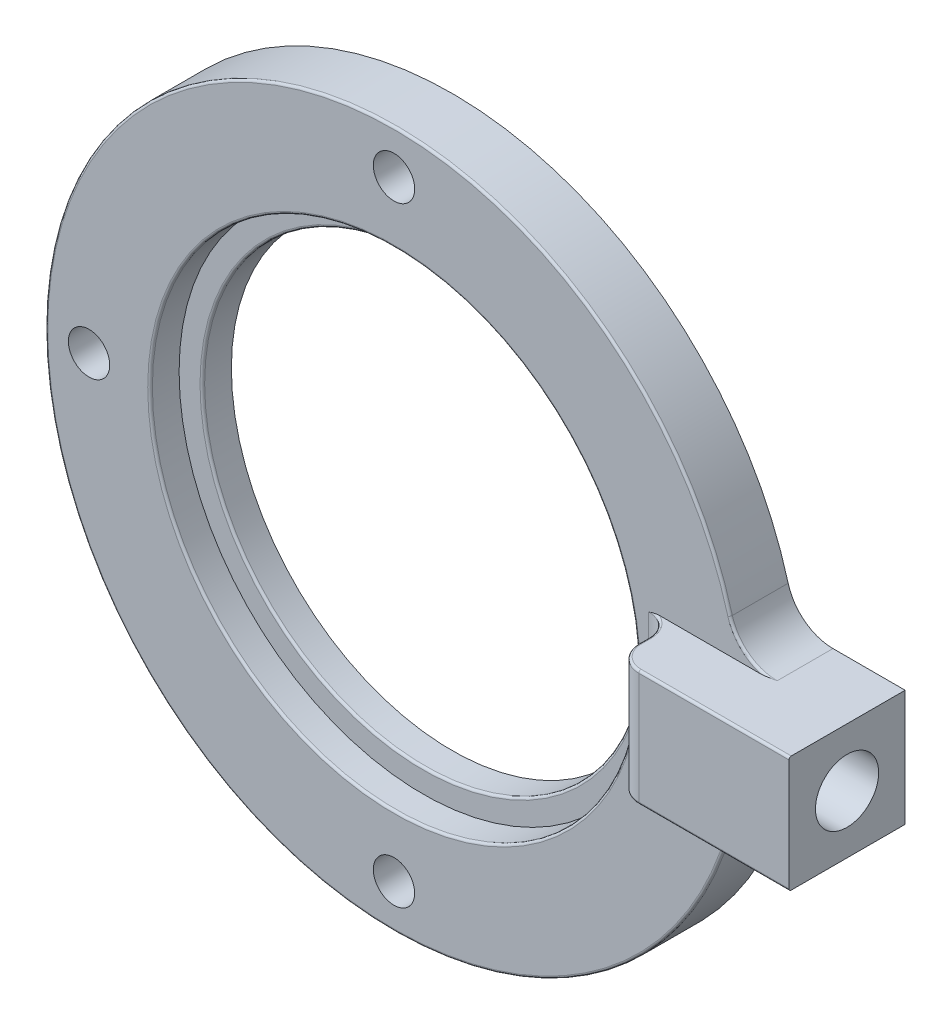
ISO-10303-21;
HEADER;
FILE_DESCRIPTION(('STEP AP214'),'2;1');
FILE_NAME('part.step','',(''),(''),'','','');
FILE_SCHEMA(('AUTOMOTIVE_DESIGN { 1 0 10303 214 1 1 1 1 }'));
ENDSEC;
DATA;
#1=APPLICATION_CONTEXT('core data for automotive mechanical design processes');
#2=APPLICATION_PROTOCOL_DEFINITION('international standard','automotive_design',2000,#1);
#3=PRODUCT_CONTEXT('',#1,'mechanical');
#4=PRODUCT('Part','Part','',(#3));
#5=PRODUCT_RELATED_PRODUCT_CATEGORY('part','',(#4));
#6=PRODUCT_DEFINITION_FORMATION('','',#4);
#7=PRODUCT_DEFINITION_CONTEXT('part definition',#1,'design');
#8=PRODUCT_DEFINITION('design','',#6,#7);
#9=PRODUCT_DEFINITION_SHAPE('','',#8);
#10=(LENGTH_UNIT() NAMED_UNIT(*) SI_UNIT(.MILLI.,.METRE.));
#11=(NAMED_UNIT(*) PLANE_ANGLE_UNIT() SI_UNIT($,.RADIAN.));
#12=(NAMED_UNIT(*) SI_UNIT($,.STERADIAN.) SOLID_ANGLE_UNIT());
#13=UNCERTAINTY_MEASURE_WITH_UNIT(LENGTH_MEASURE(1.E-05),#10,'distance_accuracy_value','');
#14=(GEOMETRIC_REPRESENTATION_CONTEXT(3) GLOBAL_UNCERTAINTY_ASSIGNED_CONTEXT((#13)) GLOBAL_UNIT_ASSIGNED_CONTEXT((#10,
#11,#12)) REPRESENTATION_CONTEXT('',''));
#15=CARTESIAN_POINT('',(0.,0.,0.));
#16=DIRECTION('',(0.,0.,1.));
#17=DIRECTION('',(1.,0.,0.));
#18=AXIS2_PLACEMENT_3D('',#15,#16,#17);
#19=CARTESIAN_POINT('',(0.,0.,3.175));
#20=DIRECTION('',(0.,0.,-1.));
#21=DIRECTION('',(-1.,0.,0.));
#22=AXIS2_PLACEMENT_3D('',#19,#20,#21);
#23=CYLINDRICAL_SURFACE('',#22,19.05);
#24=DIRECTION('',(0.,0.,-1.));
#25=VECTOR('',#24,1.);
#26=CARTESIAN_POINT('',(18.3704711599931,-5.04264705882353,3.175));
#27=LINE('',#26,#25);
#28=CARTESIAN_POINT('',(18.3704711599931,-5.04264705882353,0.));
#29=VERTEX_POINT('',#28);
#30=CARTESIAN_POINT('',(18.3704711599931,-5.04264705882353,3.048));
#31=VERTEX_POINT('',#30);
#32=EDGE_CURVE('E205',#29,#31,#27,.F.);
#33=ORIENTED_EDGE('',*,*,#32,.T.);
#34=CARTESIAN_POINT('',(0.,0.,3.048));
#35=DIRECTION('',(0.,0.,1.));
#36=DIRECTION('',(1.,0.,0.));
#37=AXIS2_PLACEMENT_3D('',#34,#35,#36);
#38=CIRCLE('',#37,19.05);
#39=CARTESIAN_POINT('',(18.3704711599931,5.04264705882353,3.048));
#40=VERTEX_POINT('',#39);
#41=EDGE_CURVE('E279',#31,#40,#38,.F.);
#42=ORIENTED_EDGE('',*,*,#41,.T.);
#43=DIRECTION('',(0.,0.,-1.));
#44=VECTOR('',#43,1.);
#45=CARTESIAN_POINT('',(18.3704711599931,5.04264705882353,3.175));
#46=LINE('',#45,#44);
#47=CARTESIAN_POINT('',(18.3704711599931,5.04264705882353,0.));
#48=VERTEX_POINT('',#47);
#49=EDGE_CURVE('E208',#40,#48,#46,.T.);
#50=ORIENTED_EDGE('',*,*,#49,.T.);
#51=CARTESIAN_POINT('',(0.,0.,0.));
#52=DIRECTION('',(0.,0.,1.));
#53=DIRECTION('',(1.,0.,0.));
#54=AXIS2_PLACEMENT_3D('',#51,#52,#53);
#55=CIRCLE('',#54,19.05);
#56=EDGE_CURVE('E199',#48,#29,#55,.T.);
#57=ORIENTED_EDGE('',*,*,#56,.T.);
#58=EDGE_LOOP('',(#33,#42,#50,#57));
#59=FACE_BOUND('',#58,.T.);
#60=ADVANCED_FACE('F35',(#59),#23,.T.);
#61=CARTESIAN_POINT('',(0.,0.,3.175));
#62=DIRECTION('',(0.,0.,1.));
#63=DIRECTION('',(1.,0.,0.));
#64=AXIS2_PLACEMENT_3D('',#61,#62,#63);
#65=PLANE('',#64);
#66=CARTESIAN_POINT('',(0.,16.66875,3.175));
#67=DIRECTION('',(0.,0.,1.));
#68=DIRECTION('',(1.,0.,0.));
#69=AXIS2_PLACEMENT_3D('',#66,#67,#68);
#70=CIRCLE('',#69,1.1303);
#71=CARTESIAN_POINT('',(1.1303,16.66875,3.175));
#72=VERTEX_POINT('',#71);
#73=EDGE_CURVE('E497',#72,#72,#70,.T.);
#74=ORIENTED_EDGE('',*,*,#73,.F.);
#75=EDGE_LOOP('',(#74));
#76=FACE_BOUND('',#75,.T.);
#77=CARTESIAN_POINT('',(0.,-16.66875,3.175));
#78=DIRECTION('',(0.,0.,1.));
#79=DIRECTION('',(1.,0.,0.));
#80=AXIS2_PLACEMENT_3D('',#77,#78,#79);
#81=CIRCLE('',#80,1.1303);
#82=CARTESIAN_POINT('',(1.1303,-16.66875,3.175));
#83=VERTEX_POINT('',#82);
#84=EDGE_CURVE('E491',#83,#83,#81,.T.);
#85=ORIENTED_EDGE('',*,*,#84,.F.);
#86=EDGE_LOOP('',(#85));
#87=FACE_BOUND('',#86,.T.);
#88=CARTESIAN_POINT('',(-16.66875,0.,3.175));
#89=DIRECTION('',(0.,0.,1.));
#90=DIRECTION('',(1.,0.,0.));
#91=AXIS2_PLACEMENT_3D('',#88,#89,#90);
#92=CIRCLE('',#91,1.1303);
#93=CARTESIAN_POINT('',(-15.53845,0.,3.175));
#94=VERTEX_POINT('',#93);
#95=EDGE_CURVE('E485',#94,#94,#92,.T.);
#96=ORIENTED_EDGE('',*,*,#95,.F.);
#97=EDGE_LOOP('',(#96));
#98=FACE_BOUND('',#97,.T.);
#99=CARTESIAN_POINT('',(0.,0.,3.175));
#100=DIRECTION('',(0.,0.,1.));
#101=DIRECTION('',(1.,0.,0.));
#102=AXIS2_PLACEMENT_3D('',#99,#100,#101);
#103=CIRCLE('',#102,13.462);
#104=CARTESIAN_POINT('',(13.462,0.,3.175));
#105=VERTEX_POINT('',#104);
#106=EDGE_CURVE('E233',#105,#105,#103,.F.);
#107=ORIENTED_EDGE('',*,*,#106,.T.);
#108=EDGE_LOOP('',(#107));
#109=FACE_BOUND('',#108,.T.);
#110=DIRECTION('',(1.,0.,0.));
#111=VECTOR('',#110,1.);
#112=CARTESIAN_POINT('',(0.,3.175,3.175));
#113=LINE('',#112,#111);
#114=CARTESIAN_POINT('',(14.5121689705204,3.175,3.175));
#115=VERTEX_POINT('',#114);
#116=CARTESIAN_POINT('',(20.0066705365049,3.175,3.175));
#117=VERTEX_POINT('',#116);
#118=EDGE_CURVE('E174',#115,#117,#113,.T.);
#119=ORIENTED_EDGE('',*,*,#118,.T.);
#120=CARTESIAN_POINT('',(20.8198673146589,5.715,3.175));
#121=DIRECTION('',(0.,0.,1.));
#122=DIRECTION('',(1.,0.,0.));
#123=AXIS2_PLACEMENT_3D('',#120,#121,#122);
#124=CIRCLE('',#123,2.667);
#125=CARTESIAN_POINT('',(18.2480013522598,5.0090294117647,3.175));
#126=VERTEX_POINT('',#125);
#127=EDGE_CURVE('E230',#117,#126,#124,.F.);
#128=ORIENTED_EDGE('',*,*,#127,.T.);
#129=CARTESIAN_POINT('',(0.,0.,3.175));
#130=DIRECTION('',(0.,0.,1.));
#131=DIRECTION('',(1.,0.,0.));
#132=AXIS2_PLACEMENT_3D('',#129,#130,#131);
#133=CIRCLE('',#132,18.923);
#134=CARTESIAN_POINT('',(18.2480013522598,-5.0090294117647,3.175));
#135=VERTEX_POINT('',#134);
#136=EDGE_CURVE('E226',#126,#135,#133,.T.);
#137=ORIENTED_EDGE('',*,*,#136,.T.);
#138=CARTESIAN_POINT('',(20.8198673146589,-5.715,3.175));
#139=DIRECTION('',(0.,0.,1.));
#140=DIRECTION('',(1.,0.,0.));
#141=AXIS2_PLACEMENT_3D('',#138,#139,#140);
#142=CIRCLE('',#141,2.667);
#143=CARTESIAN_POINT('',(20.0066705365049,-3.175,3.175));
#144=VERTEX_POINT('',#143);
#145=EDGE_CURVE('E228',#135,#144,#142,.F.);
#146=ORIENTED_EDGE('',*,*,#145,.T.);
#147=DIRECTION('',(-1.,0.,0.));
#148=VECTOR('',#147,1.);
#149=CARTESIAN_POINT('',(0.,-3.175,3.175));
#150=LINE('',#149,#148);
#151=CARTESIAN_POINT('',(14.5121689705204,-3.175,3.175));
#152=VERTEX_POINT('',#151);
#153=EDGE_CURVE('E190',#144,#152,#150,.T.);
#154=ORIENTED_EDGE('',*,*,#153,.T.);
#155=CARTESIAN_POINT('',(14.5121689705204,-3.175,3.175));
#156=CARTESIAN_POINT('',(14.490697195344,-3.17497975884267,3.175));
#157=CARTESIAN_POINT('',(14.4692504761618,-3.17408902116841,3.175));
#158=CARTESIAN_POINT('',(14.426494060143,-3.17089117084889,3.175));
#159=CARTESIAN_POINT('',(14.4051841984233,-3.16858633814492,3.175));
#160=CARTESIAN_POINT('',(14.3628370270473,-3.16289862854949,3.175));
#161=CARTESIAN_POINT('',(14.3417988608336,-3.15952181473834,3.175));
#162=CARTESIAN_POINT('',(14.2998716225293,-3.15190166302931,3.175));
#163=CARTESIAN_POINT('',(14.2789826245387,-3.14765792178961,3.175));
#164=CARTESIAN_POINT('',(14.2020779938584,-3.13073562530817,3.175));
#165=CARTESIAN_POINT('',(14.1465342068225,-3.11595191436639,3.175));
#166=CARTESIAN_POINT('',(14.0360369041027,-3.08417963785667,3.175));
#167=CARTESIAN_POINT('',(13.9810844759537,-3.06718757981551,3.175));
#168=CARTESIAN_POINT('',(13.9238283053032,-3.04943517549649,3.175));
#169=CARTESIAN_POINT('',(13.9215141557331,-3.04871758649849,3.175));
#170=CARTESIAN_POINT('',(13.9192,-3.048,3.175));
#171=B_SPLINE_CURVE_WITH_KNOTS('',3,(#155,#156,#157,#158,#159,#160,#161,#162,#163,#164,#165,
#166,#167,#168,#169,#170),.UNSPECIFIED.,.F.,.F.,(4,2,2,2,2,2,2,4),(0.,0.0643629121915494,
0.128622323958822,0.192524575435322,0.256456625706736,0.428747907985684,0.601315060117932,
0.608583622856021),.UNSPECIFIED.);
#172=CARTESIAN_POINT('',(13.9192,-3.048,3.175));
#173=VERTEX_POINT('',#172);
#174=EDGE_CURVE('E44',#152,#173,#171,.T.);
#175=ORIENTED_EDGE('',*,*,#174,.T.);
#176=DIRECTION('',(0.,1.,0.));
#177=VECTOR('',#176,1.);
#178=CARTESIAN_POINT('',(13.9192,0.,3.175));
#179=LINE('',#178,#177);
#180=CARTESIAN_POINT('',(13.9192,3.048,3.175));
#181=VERTEX_POINT('',#180);
#182=EDGE_CURVE('E223',#173,#181,#179,.T.);
#183=ORIENTED_EDGE('',*,*,#182,.T.);
#184=CARTESIAN_POINT('',(14.5121689705204,3.175,3.175));
#185=CARTESIAN_POINT('',(14.490697195344,3.17497975884267,3.175));
#186=CARTESIAN_POINT('',(14.4692504761618,3.17408902116842,3.175));
#187=CARTESIAN_POINT('',(14.426494060143,3.17089117084889,3.175));
#188=CARTESIAN_POINT('',(14.4051841984233,3.16858633814492,3.175));
#189=CARTESIAN_POINT('',(14.3628370270473,3.16289862854949,3.175));
#190=CARTESIAN_POINT('',(14.3417988608336,3.15952181473834,3.175));
#191=CARTESIAN_POINT('',(14.2998716225293,3.15190166302931,3.175));
#192=CARTESIAN_POINT('',(14.2789826245387,3.14765792178962,3.175));
#193=CARTESIAN_POINT('',(14.2020779938584,3.13073562530817,3.175));
#194=CARTESIAN_POINT('',(14.1465342068225,3.11595191436639,3.175));
#195=CARTESIAN_POINT('',(14.0360369041027,3.08417963785667,3.175));
#196=CARTESIAN_POINT('',(13.9810844759537,3.0671875798155,3.175));
#197=CARTESIAN_POINT('',(13.9238283053032,3.04943517549649,3.175));
#198=CARTESIAN_POINT('',(13.9215141557331,3.04871758649849,3.175));
#199=CARTESIAN_POINT('',(13.9192,3.048,3.175));
#200=B_SPLINE_CURVE_WITH_KNOTS('',3,(#184,#185,#186,#187,#188,#189,#190,#191,#192,#193,#194,
#195,#196,#197,#198,#199),.UNSPECIFIED.,.F.,.F.,(4,2,2,2,2,2,2,4),(0.,0.0643629121915512,
0.128622323958824,0.192524575435323,0.256456625706736,0.42874790798568,0.60131506011793,
0.608583622856021),.UNSPECIFIED.);
#201=EDGE_CURVE('E12',#181,#115,#200,.F.);
#202=ORIENTED_EDGE('',*,*,#201,.T.);
#203=EDGE_LOOP('',(#119,#128,#137,#146,#154,#175,#183,#202));
#204=FACE_BOUND('',#203,.T.);
#205=ADVANCED_FACE('F328',(#76,#87,#98,#109,#204),#65,.T.);
#206=CARTESIAN_POINT('',(0.,0.,0.));
#207=DIRECTION('',(0.,0.,1.));
#208=DIRECTION('',(1.,0.,0.));
#209=AXIS2_PLACEMENT_3D('',#206,#207,#208);
#210=CYLINDRICAL_SURFACE('',#209,12.065);
#211=CARTESIAN_POINT('',(0.,0.,1.4605));
#212=DIRECTION('',(0.,0.,1.));
#213=DIRECTION('',(1.,0.,0.));
#214=AXIS2_PLACEMENT_3D('',#211,#212,#213);
#215=CIRCLE('',#214,12.065);
#216=CARTESIAN_POINT('',(12.065,0.,1.4605));
#217=VERTEX_POINT('',#216);
#218=EDGE_CURVE('E273',#217,#217,#215,.T.);
#219=ORIENTED_EDGE('',*,*,#218,.T.);
#220=EDGE_LOOP('',(#219));
#221=FACE_BOUND('',#220,.T.);
#222=CARTESIAN_POINT('',(0.,0.,0.));
#223=DIRECTION('',(0.,0.,1.));
#224=DIRECTION('',(1.,0.,0.));
#225=AXIS2_PLACEMENT_3D('',#222,#223,#224);
#226=CIRCLE('',#225,12.065);
#227=CARTESIAN_POINT('',(12.065,0.,0.));
#228=VERTEX_POINT('',#227);
#229=EDGE_CURVE('E196',#228,#228,#226,.T.);
#230=ORIENTED_EDGE('',*,*,#229,.F.);
#231=EDGE_LOOP('',(#230));
#232=FACE_BOUND('',#231,.T.);
#233=ADVANCED_FACE('F325',(#221,#232),#210,.F.);
#234=CARTESIAN_POINT('',(0.,0.,0.));
#235=DIRECTION('',(0.,0.,1.));
#236=DIRECTION('',(1.,0.,0.));
#237=AXIS2_PLACEMENT_3D('',#234,#235,#236);
#238=PLANE('',#237);
#239=CARTESIAN_POINT('',(0.,16.66875,0.));
#240=DIRECTION('',(0.,0.,1.));
#241=DIRECTION('',(1.,0.,0.));
#242=AXIS2_PLACEMENT_3D('',#239,#240,#241);
#243=CIRCLE('',#242,1.1303);
#244=CARTESIAN_POINT('',(1.1303,16.66875,0.));
#245=VERTEX_POINT('',#244);
#246=EDGE_CURVE('E488',#245,#245,#243,.T.);
#247=ORIENTED_EDGE('',*,*,#246,.T.);
#248=EDGE_LOOP('',(#247));
#249=FACE_BOUND('',#248,.T.);
#250=CARTESIAN_POINT('',(0.,-16.66875,0.));
#251=DIRECTION('',(0.,0.,1.));
#252=DIRECTION('',(1.,0.,0.));
#253=AXIS2_PLACEMENT_3D('',#250,#251,#252);
#254=CIRCLE('',#253,1.1303);
#255=CARTESIAN_POINT('',(1.1303,-16.66875,0.));
#256=VERTEX_POINT('',#255);
#257=EDGE_CURVE('E494',#256,#256,#254,.T.);
#258=ORIENTED_EDGE('',*,*,#257,.T.);
#259=EDGE_LOOP('',(#258));
#260=FACE_BOUND('',#259,.T.);
#261=CARTESIAN_POINT('',(-16.66875,0.,0.));
#262=DIRECTION('',(0.,0.,1.));
#263=DIRECTION('',(1.,0.,0.));
#264=AXIS2_PLACEMENT_3D('',#261,#262,#263);
#265=CIRCLE('',#264,1.1303);
#266=CARTESIAN_POINT('',(-15.53845,0.,0.));
#267=VERTEX_POINT('',#266);
#268=EDGE_CURVE('E430',#267,#267,#265,.T.);
#269=ORIENTED_EDGE('',*,*,#268,.T.);
#270=EDGE_LOOP('',(#269));
#271=FACE_BOUND('',#270,.T.);
#272=ORIENTED_EDGE('',*,*,#56,.F.);
#273=CARTESIAN_POINT('',(20.8198673146589,5.715,0.));
#274=DIRECTION('',(0.,0.,1.));
#275=DIRECTION('',(1.,0.,0.));
#276=AXIS2_PLACEMENT_3D('',#273,#274,#275);
#277=CIRCLE('',#276,2.54);
#278=CARTESIAN_POINT('',(20.8198673146589,3.175,0.));
#279=VERTEX_POINT('',#278);
#280=EDGE_CURVE('E211',#48,#279,#277,.T.);
#281=ORIENTED_EDGE('',*,*,#280,.T.);
#282=DIRECTION('',(-1.,0.,0.));
#283=VECTOR('',#282,1.);
#284=CARTESIAN_POINT('',(24.765,3.175,0.));
#285=LINE('',#284,#283);
#286=CARTESIAN_POINT('',(24.765,3.175,0.));
#287=VERTEX_POINT('',#286);
#288=EDGE_CURVE('E175',#287,#279,#285,.T.);
#289=ORIENTED_EDGE('',*,*,#288,.F.);
#290=DIRECTION('',(0.,1.,0.));
#291=VECTOR('',#290,1.);
#292=CARTESIAN_POINT('',(24.765,-3.175,0.));
#293=LINE('',#292,#291);
#294=CARTESIAN_POINT('',(24.765,-3.175,0.));
#295=VERTEX_POINT('',#294);
#296=EDGE_CURVE('E159',#295,#287,#293,.T.);
#297=ORIENTED_EDGE('',*,*,#296,.F.);
#298=DIRECTION('',(-1.,0.,0.));
#299=VECTOR('',#298,1.);
#300=CARTESIAN_POINT('',(24.765,-3.175,0.));
#301=LINE('',#300,#299);
#302=CARTESIAN_POINT('',(20.8198673146589,-3.175,0.));
#303=VERTEX_POINT('',#302);
#304=EDGE_CURVE('E168',#295,#303,#301,.T.);
#305=ORIENTED_EDGE('',*,*,#304,.T.);
#306=CARTESIAN_POINT('',(20.8198673146589,-5.715,0.));
#307=DIRECTION('',(0.,0.,1.));
#308=DIRECTION('',(1.,0.,0.));
#309=AXIS2_PLACEMENT_3D('',#306,#307,#308);
#310=CIRCLE('',#309,2.54);
#311=EDGE_CURVE('E213',#303,#29,#310,.T.);
#312=ORIENTED_EDGE('',*,*,#311,.T.);
#313=EDGE_LOOP('',(#272,#281,#289,#297,#305,#312));
#314=FACE_BOUND('',#313,.T.);
#315=ORIENTED_EDGE('',*,*,#229,.T.);
#316=EDGE_LOOP('',(#315));
#317=FACE_BOUND('',#316,.T.);
#318=ADVANCED_FACE('F178',(#249,#260,#271,#314,#317),#238,.F.);
#319=CARTESIAN_POINT('',(0.,0.,1.5875));
#320=DIRECTION('',(0.,0.,1.));
#321=DIRECTION('',(1.,0.,0.));
#322=AXIS2_PLACEMENT_3D('',#319,#320,#321);
#323=PLANE('',#322);
#324=CARTESIAN_POINT('',(0.,0.,1.5875));
#325=DIRECTION('',(0.,0.,1.));
#326=DIRECTION('',(1.,0.,0.));
#327=AXIS2_PLACEMENT_3D('',#324,#325,#326);
#328=CIRCLE('',#327,12.192);
#329=CARTESIAN_POINT('',(12.192,0.,1.5875));
#330=VERTEX_POINT('',#329);
#331=EDGE_CURVE('E270',#330,#330,#328,.F.);
#332=ORIENTED_EDGE('',*,*,#331,.T.);
#333=EDGE_LOOP('',(#332));
#334=FACE_BOUND('',#333,.T.);
#335=CARTESIAN_POINT('',(0.,0.,1.5875));
#336=DIRECTION('',(0.,0.,1.));
#337=DIRECTION('',(1.,0.,0.));
#338=AXIS2_PLACEMENT_3D('',#335,#336,#337);
#339=CIRCLE('',#338,13.335);
#340=CARTESIAN_POINT('',(13.335,0.,1.5875));
#341=VERTEX_POINT('',#340);
#342=EDGE_CURVE('E193',#341,#341,#339,.F.);
#343=ORIENTED_EDGE('',*,*,#342,.F.);
#344=EDGE_LOOP('',(#343));
#345=FACE_BOUND('',#344,.T.);
#346=ADVANCED_FACE('F318',(#334,#345),#323,.T.);
#347=CARTESIAN_POINT('',(0.,0.,-37.7170757084904));
#348=DIRECTION('',(0.,0.,1.));
#349=DIRECTION('',(1.,0.,0.));
#350=AXIS2_PLACEMENT_3D('',#347,#348,#349);
#351=CYLINDRICAL_SURFACE('',#350,13.335);
#352=CARTESIAN_POINT('',(0.,0.,3.048));
#353=DIRECTION('',(0.,0.,1.));
#354=DIRECTION('',(1.,0.,0.));
#355=AXIS2_PLACEMENT_3D('',#352,#353,#354);
#356=CIRCLE('',#355,13.335);
#357=CARTESIAN_POINT('',(13.335,0.,3.048));
#358=VERTEX_POINT('',#357);
#359=EDGE_CURVE('E276',#358,#358,#356,.T.);
#360=ORIENTED_EDGE('',*,*,#359,.T.);
#361=EDGE_LOOP('',(#360));
#362=FACE_BOUND('',#361,.T.);
#363=ORIENTED_EDGE('',*,*,#342,.T.);
#364=EDGE_LOOP('',(#363));
#365=FACE_BOUND('',#364,.T.);
#366=ADVANCED_FACE('F315',(#362,#365),#351,.F.);
#367=CARTESIAN_POINT('',(24.765,-3.175,0.));
#368=DIRECTION('',(0.,1.,0.));
#369=DIRECTION('',(0.,0.,1.));
#370=AXIS2_PLACEMENT_3D('',#367,#368,#369);
#371=PLANE('',#370);
#372=DIRECTION('',(0.,0.,-1.));
#373=VECTOR('',#372,1.);
#374=CARTESIAN_POINT('',(15.367,-3.175,0.));
#375=LINE('',#374,#373);
#376=CARTESIAN_POINT('',(15.367,-3.175,5.0292));
#377=VERTEX_POINT('',#376);
#378=CARTESIAN_POINT('',(15.367,-3.175,4.4958));
#379=VERTEX_POINT('',#378);
#380=EDGE_CURVE('E244',#377,#379,#375,.T.);
#381=ORIENTED_EDGE('',*,*,#380,.T.);
#382=CARTESIAN_POINT('',(13.9192,-3.175,4.4958));
#383=DIRECTION('',(0.,1.,0.));
#384=DIRECTION('',(0.,0.,1.));
#385=AXIS2_PLACEMENT_3D('',#382,#383,#384);
#386=CIRCLE('',#385,1.4478);
#387=EDGE_CURVE('E246',#379,#152,#386,.T.);
#388=ORIENTED_EDGE('',*,*,#387,.T.);
#389=ORIENTED_EDGE('',*,*,#153,.F.);
#390=CARTESIAN_POINT('',(20.0066705365049,-3.175,3.175));
#391=CARTESIAN_POINT('',(20.027946612039,-3.175,3.17499285010355));
#392=CARTESIAN_POINT('',(20.0492154190392,-3.175,3.17450392293874));
#393=CARTESIAN_POINT('',(20.0917094310848,-3.175,3.17271146799838));
#394=CARTESIAN_POINT('',(20.1129346521213,-3.175,3.1714083300243));
#395=CARTESIAN_POINT('',(20.1764249941339,-3.175,3.16650826044101));
#396=CARTESIAN_POINT('',(20.2186122298688,-3.175,3.16191913043132));
#397=CARTESIAN_POINT('',(20.3068869422796,-3.175,3.15033108499017));
#398=CARTESIAN_POINT('',(20.3529476655832,-3.175,3.14313878143618));
#399=CARTESIAN_POINT('',(20.4448080654936,-3.175,3.1272265592785));
#400=CARTESIAN_POINT('',(20.4906076865312,-3.175,3.11850632716824));
#401=CARTESIAN_POINT('',(20.6278195206221,-3.175,3.090893931761));
#402=CARTESIAN_POINT('',(20.7189355808589,-3.17500000000001,3.07056732551881));
#403=CARTESIAN_POINT('',(20.8133094819826,-3.175,3.04946634758811));
#404=CARTESIAN_POINT('',(20.8165884032865,-3.175,3.04873315690517));
#405=CARTESIAN_POINT('',(20.8198673146589,-3.175,3.048));
#406=B_SPLINE_CURVE_WITH_KNOTS('',3,(#390,#391,#392,#393,#394,#395,#396,#397,#398,#399,#400,
#401,#402,#403,#404,#405),.UNSPECIFIED.,.F.,.F.,(4,2,2,2,2,2,2,4),(0.,0.063812167547438,
0.127593808556728,0.254835432874251,0.394656814457322,0.534506918826331,0.814538203590491,
0.824617886149236),.UNSPECIFIED.);
#407=CARTESIAN_POINT('',(20.8198673146589,-3.175,3.048));
#408=VERTEX_POINT('',#407);
#409=EDGE_CURVE('E293',#144,#408,#406,.T.);
#410=ORIENTED_EDGE('',*,*,#409,.T.);
#411=DIRECTION('',(0.,0.,1.));
#412=VECTOR('',#411,1.);
#413=CARTESIAN_POINT('',(20.8198673146589,-3.175,0.));
#414=LINE('',#413,#412);
#415=EDGE_CURVE('E171',#408,#303,#414,.F.);
#416=ORIENTED_EDGE('',*,*,#415,.T.);
#417=ORIENTED_EDGE('',*,*,#304,.F.);
#418=DIRECTION('',(0.,0.,-1.));
#419=VECTOR('',#418,1.);
#420=CARTESIAN_POINT('',(24.765,-3.175,0.));
#421=LINE('',#420,#419);
#422=CARTESIAN_POINT('',(24.765,-3.175,6.223));
#423=VERTEX_POINT('',#422);
#424=EDGE_CURVE('E155',#423,#295,#421,.T.);
#425=ORIENTED_EDGE('',*,*,#424,.F.);
#426=DIRECTION('',(-1.,0.,0.));
#427=VECTOR('',#426,1.);
#428=CARTESIAN_POINT('',(24.765,-3.175,6.223));
#429=LINE('',#428,#427);
#430=CARTESIAN_POINT('',(16.5608,-3.175,6.223));
#431=VERTEX_POINT('',#430);
#432=EDGE_CURVE('E240',#423,#431,#429,.T.);
#433=ORIENTED_EDGE('',*,*,#432,.T.);
#434=CARTESIAN_POINT('',(16.5608,-3.175,5.0292));
#435=DIRECTION('',(0.,1.,0.));
#436=DIRECTION('',(0.,0.,1.));
#437=AXIS2_PLACEMENT_3D('',#434,#435,#436);
#438=CIRCLE('',#437,1.1938);
#439=EDGE_CURVE('E242',#431,#377,#438,.F.);
#440=ORIENTED_EDGE('',*,*,#439,.T.);
#441=EDGE_LOOP('',(#381,#388,#389,#410,#416,#417,#425,#433,#440));
#442=FACE_BOUND('',#441,.T.);
#443=ADVANCED_FACE('F169',(#442),#371,.F.);
#444=CARTESIAN_POINT('',(24.765,3.175,0.));
#445=DIRECTION('',(0.,-1.,0.));
#446=DIRECTION('',(0.,0.,-1.));
#447=AXIS2_PLACEMENT_3D('',#444,#445,#446);
#448=PLANE('',#447);
#449=ORIENTED_EDGE('',*,*,#118,.F.);
#450=CARTESIAN_POINT('',(13.9192,3.175,4.4958));
#451=DIRECTION('',(0.,-1.,0.));
#452=DIRECTION('',(0.,0.,-1.));
#453=AXIS2_PLACEMENT_3D('',#450,#451,#452);
#454=CIRCLE('',#453,1.4478);
#455=CARTESIAN_POINT('',(15.367,3.175,4.4958));
#456=VERTEX_POINT('',#455);
#457=EDGE_CURVE('E267',#115,#456,#454,.T.);
#458=ORIENTED_EDGE('',*,*,#457,.T.);
#459=DIRECTION('',(0.,0.,1.));
#460=VECTOR('',#459,1.);
#461=CARTESIAN_POINT('',(15.367,3.175,0.));
#462=LINE('',#461,#460);
#463=CARTESIAN_POINT('',(15.367,3.175,5.0292));
#464=VERTEX_POINT('',#463);
#465=EDGE_CURVE('E265',#456,#464,#462,.T.);
#466=ORIENTED_EDGE('',*,*,#465,.T.);
#467=CARTESIAN_POINT('',(16.5608,3.175,5.0292));
#468=DIRECTION('',(0.,-1.,0.));
#469=DIRECTION('',(0.,0.,-1.));
#470=AXIS2_PLACEMENT_3D('',#467,#468,#469);
#471=CIRCLE('',#470,1.1938);
#472=CARTESIAN_POINT('',(16.5608,3.175,6.223));
#473=VERTEX_POINT('',#472);
#474=EDGE_CURVE('E263',#464,#473,#471,.F.);
#475=ORIENTED_EDGE('',*,*,#474,.T.);
#476=DIRECTION('',(-1.,0.,0.));
#477=VECTOR('',#476,1.);
#478=CARTESIAN_POINT('',(24.765,3.175,6.223));
#479=LINE('',#478,#477);
#480=CARTESIAN_POINT('',(24.765,3.175,6.223));
#481=VERTEX_POINT('',#480);
#482=EDGE_CURVE('E261',#473,#481,#479,.F.);
#483=ORIENTED_EDGE('',*,*,#482,.T.);
#484=DIRECTION('',(0.,0.,1.));
#485=VECTOR('',#484,1.);
#486=CARTESIAN_POINT('',(24.765,3.175,0.));
#487=LINE('',#486,#485);
#488=EDGE_CURVE('E182',#287,#481,#487,.T.);
#489=ORIENTED_EDGE('',*,*,#488,.F.);
#490=ORIENTED_EDGE('',*,*,#288,.T.);
#491=DIRECTION('',(0.,0.,1.));
#492=VECTOR('',#491,1.);
#493=CARTESIAN_POINT('',(20.8198673146589,3.175,3.175));
#494=LINE('',#493,#492);
#495=CARTESIAN_POINT('',(20.8198673146589,3.175,3.048));
#496=VERTEX_POINT('',#495);
#497=EDGE_CURVE('E202',#279,#496,#494,.T.);
#498=ORIENTED_EDGE('',*,*,#497,.T.);
#499=CARTESIAN_POINT('',(20.0066705365049,3.175,3.175));
#500=CARTESIAN_POINT('',(20.027946612039,3.175,3.17499285010355));
#501=CARTESIAN_POINT('',(20.0492154190392,3.175,3.17450392293874));
#502=CARTESIAN_POINT('',(20.0917094310848,3.175,3.17271146799838));
#503=CARTESIAN_POINT('',(20.1129346521213,3.175,3.1714083300243));
#504=CARTESIAN_POINT('',(20.1764249941339,3.175,3.16650826044101));
#505=CARTESIAN_POINT('',(20.2186122298688,3.175,3.16191913043132));
#506=CARTESIAN_POINT('',(20.3068869422796,3.175,3.15033108499018));
#507=CARTESIAN_POINT('',(20.3529476655832,3.175,3.14313878143619));
#508=CARTESIAN_POINT('',(20.4448080654936,3.175,3.12722655927849));
#509=CARTESIAN_POINT('',(20.4906076865312,3.175,3.1185063271682));
#510=CARTESIAN_POINT('',(20.6278195206221,3.175,3.09089393176108));
#511=CARTESIAN_POINT('',(20.718935580859,3.17500000000001,3.07056732551926));
#512=CARTESIAN_POINT('',(20.8133094819826,3.175,3.04946634758814));
#513=CARTESIAN_POINT('',(20.8165884032865,3.175,3.04873315690519));
#514=CARTESIAN_POINT('',(20.8198673146589,3.175,3.048));
#515=B_SPLINE_CURVE_WITH_KNOTS('',3,(#499,#500,#501,#502,#503,#504,#505,#506,#507,#508,#509,
#510,#511,#512,#513,#514),.UNSPECIFIED.,.F.,.F.,(4,2,2,2,2,2,2,4),(0.,0.0638121675474242,
0.127593808556703,0.254835432874251,0.394656814457315,0.534506918826331,0.814538203590481,
0.824617886149234),.UNSPECIFIED.);
#516=EDGE_CURVE('E286',#496,#117,#515,.F.);
#517=ORIENTED_EDGE('',*,*,#516,.T.);
#518=EDGE_LOOP('',(#449,#458,#466,#475,#483,#489,#490,#498,#517));
#519=FACE_BOUND('',#518,.T.);
#520=ADVANCED_FACE('F304',(#519),#448,.F.);
#521=CARTESIAN_POINT('',(24.765,-3.175,6.35));
#522=DIRECTION('',(0.,0.,-1.));
#523=DIRECTION('',(-1.,0.,0.));
#524=AXIS2_PLACEMENT_3D('',#521,#522,#523);
#525=PLANE('',#524);
#526=DIRECTION('',(0.,-1.,0.));
#527=VECTOR('',#526,1.);
#528=CARTESIAN_POINT('',(16.5608,-3.175,6.35));
#529=LINE('',#528,#527);
#530=CARTESIAN_POINT('',(16.5608,3.048,6.35));
#531=VERTEX_POINT('',#530);
#532=CARTESIAN_POINT('',(16.5608,-3.048,6.35));
#533=VERTEX_POINT('',#532);
#534=EDGE_CURVE('E215',#531,#533,#529,.T.);
#535=ORIENTED_EDGE('',*,*,#534,.T.);
#536=DIRECTION('',(-1.,0.,0.));
#537=VECTOR('',#536,1.);
#538=CARTESIAN_POINT('',(24.765,-3.048,6.35));
#539=LINE('',#538,#537);
#540=CARTESIAN_POINT('',(24.765,-3.048,6.35));
#541=VERTEX_POINT('',#540);
#542=EDGE_CURVE('E52',#533,#541,#539,.F.);
#543=ORIENTED_EDGE('',*,*,#542,.T.);
#544=DIRECTION('',(0.,-1.,0.));
#545=VECTOR('',#544,1.);
#546=CARTESIAN_POINT('',(24.765,-3.175,6.35));
#547=LINE('',#546,#545);
#548=CARTESIAN_POINT('',(24.765,3.048,6.35));
#549=VERTEX_POINT('',#548);
#550=EDGE_CURVE('E165',#549,#541,#547,.T.);
#551=ORIENTED_EDGE('',*,*,#550,.F.);
#552=DIRECTION('',(-1.,0.,0.));
#553=VECTOR('',#552,1.);
#554=CARTESIAN_POINT('',(24.765,3.048,6.35));
#555=LINE('',#554,#553);
#556=EDGE_CURVE('E281',#549,#531,#555,.T.);
#557=ORIENTED_EDGE('',*,*,#556,.T.);
#558=EDGE_LOOP('',(#535,#543,#551,#557));
#559=FACE_BOUND('',#558,.T.);
#560=ADVANCED_FACE('F308',(#559),#525,.F.);
#561=CARTESIAN_POINT('',(24.765,0.,0.));
#562=DIRECTION('',(1.,0.,0.));
#563=DIRECTION('',(0.,0.,-1.));
#564=AXIS2_PLACEMENT_3D('',#561,#562,#563);
#565=PLANE('',#564);
#566=CARTESIAN_POINT('',(24.765,0.,3.175));
#567=DIRECTION('',(1.,0.,0.));
#568=DIRECTION('',(0.,0.,-1.));
#569=AXIS2_PLACEMENT_3D('',#566,#567,#568);
#570=CIRCLE('',#569,1.7272);
#571=CARTESIAN_POINT('',(24.765,0.,1.4478));
#572=VERTEX_POINT('',#571);
#573=EDGE_CURVE('E476',#572,#572,#570,.T.);
#574=ORIENTED_EDGE('',*,*,#573,.F.);
#575=EDGE_LOOP('',(#574));
#576=FACE_BOUND('',#575,.T.);
#577=ORIENTED_EDGE('',*,*,#550,.T.);
#578=CARTESIAN_POINT('',(24.765,-3.048,6.223));
#579=DIRECTION('',(1.,0.,0.));
#580=DIRECTION('',(0.,0.,-1.));
#581=AXIS2_PLACEMENT_3D('',#578,#579,#580);
#582=CIRCLE('',#581,0.127);
#583=EDGE_CURVE('E162',#541,#423,#582,.T.);
#584=ORIENTED_EDGE('',*,*,#583,.T.);
#585=ORIENTED_EDGE('',*,*,#424,.T.);
#586=ORIENTED_EDGE('',*,*,#296,.T.);
#587=ORIENTED_EDGE('',*,*,#488,.T.);
#588=CARTESIAN_POINT('',(24.765,3.048,6.223));
#589=DIRECTION('',(1.,0.,0.));
#590=DIRECTION('',(0.,0.,-1.));
#591=AXIS2_PLACEMENT_3D('',#588,#589,#590);
#592=CIRCLE('',#591,0.127);
#593=EDGE_CURVE('E59',#481,#549,#592,.T.);
#594=ORIENTED_EDGE('',*,*,#593,.T.);
#595=EDGE_LOOP('',(#577,#584,#585,#586,#587,#594));
#596=FACE_BOUND('',#595,.T.);
#597=ADVANCED_FACE('F157',(#576,#596),#565,.T.);
#598=CARTESIAN_POINT('',(15.24,0.,0.));
#599=DIRECTION('',(1.,0.,0.));
#600=DIRECTION('',(0.,0.,-1.));
#601=AXIS2_PLACEMENT_3D('',#598,#599,#600);
#602=PLANE('',#601);
#603=DIRECTION('',(0.,1.,0.));
#604=VECTOR('',#603,1.);
#605=CARTESIAN_POINT('',(15.24,0.,4.4958));
#606=LINE('',#605,#604);
#607=CARTESIAN_POINT('',(15.24,3.048,4.4958));
#608=VERTEX_POINT('',#607);
#609=CARTESIAN_POINT('',(15.24,-3.048,4.4958));
#610=VERTEX_POINT('',#609);
#611=EDGE_CURVE('E217',#608,#610,#606,.F.);
#612=ORIENTED_EDGE('',*,*,#611,.T.);
#613=DIRECTION('',(0.,0.,-1.));
#614=VECTOR('',#613,1.);
#615=CARTESIAN_POINT('',(15.24,-3.048,0.));
#616=LINE('',#615,#614);
#617=CARTESIAN_POINT('',(15.24,-3.048,5.0292));
#618=VERTEX_POINT('',#617);
#619=EDGE_CURVE('E255',#610,#618,#616,.F.);
#620=ORIENTED_EDGE('',*,*,#619,.T.);
#621=DIRECTION('',(0.,-1.,0.));
#622=VECTOR('',#621,1.);
#623=CARTESIAN_POINT('',(15.24,0.,5.0292));
#624=LINE('',#623,#622);
#625=CARTESIAN_POINT('',(15.24,3.048,5.0292));
#626=VERTEX_POINT('',#625);
#627=EDGE_CURVE('E220',#618,#626,#624,.F.);
#628=ORIENTED_EDGE('',*,*,#627,.T.);
#629=DIRECTION('',(0.,0.,1.));
#630=VECTOR('',#629,1.);
#631=CARTESIAN_POINT('',(15.24,3.048,0.));
#632=LINE('',#631,#630);
#633=EDGE_CURVE('E253',#626,#608,#632,.F.);
#634=ORIENTED_EDGE('',*,*,#633,.T.);
#635=EDGE_LOOP('',(#612,#620,#628,#634));
#636=FACE_BOUND('',#635,.T.);
#637=ADVANCED_FACE('F310',(#636),#602,.F.);
#638=CARTESIAN_POINT('',(20.8198673146589,5.715,3.175));
#639=DIRECTION('',(0.,0.,-1.));
#640=DIRECTION('',(-1.,0.,0.));
#641=AXIS2_PLACEMENT_3D('',#638,#639,#640);
#642=CYLINDRICAL_SURFACE('',#641,2.54);
#643=ORIENTED_EDGE('',*,*,#49,.F.);
#644=CARTESIAN_POINT('',(20.8198673146589,5.715,3.048));
#645=DIRECTION('',(0.,0.,1.));
#646=DIRECTION('',(1.,0.,0.));
#647=AXIS2_PLACEMENT_3D('',#644,#645,#646);
#648=CIRCLE('',#647,2.54);
#649=EDGE_CURVE('E236',#40,#496,#648,.T.);
#650=ORIENTED_EDGE('',*,*,#649,.T.);
#651=ORIENTED_EDGE('',*,*,#497,.F.);
#652=ORIENTED_EDGE('',*,*,#280,.F.);
#653=EDGE_LOOP('',(#643,#650,#651,#652));
#654=FACE_BOUND('',#653,.T.);
#655=ADVANCED_FACE('F382',(#654),#642,.F.);
#656=CARTESIAN_POINT('',(20.8198673146589,-5.715,3.175));
#657=DIRECTION('',(0.,0.,-1.));
#658=DIRECTION('',(-1.,0.,0.));
#659=AXIS2_PLACEMENT_3D('',#656,#657,#658);
#660=CYLINDRICAL_SURFACE('',#659,2.54);
#661=ORIENTED_EDGE('',*,*,#415,.F.);
#662=CARTESIAN_POINT('',(20.8198673146589,-5.715,3.048));
#663=DIRECTION('',(0.,0.,1.));
#664=DIRECTION('',(1.,0.,0.));
#665=AXIS2_PLACEMENT_3D('',#662,#663,#664);
#666=CIRCLE('',#665,2.54);
#667=EDGE_CURVE('E238',#408,#31,#666,.T.);
#668=ORIENTED_EDGE('',*,*,#667,.T.);
#669=ORIENTED_EDGE('',*,*,#32,.F.);
#670=ORIENTED_EDGE('',*,*,#311,.F.);
#671=EDGE_LOOP('',(#661,#668,#669,#670));
#672=FACE_BOUND('',#671,.T.);
#673=ADVANCED_FACE('F385',(#672),#660,.F.);
#674=CARTESIAN_POINT('',(17.145,0.,3.175));
#675=DIRECTION('',(1.,0.,0.));
#676=DIRECTION('',(0.,0.,-1.));
#677=AXIS2_PLACEMENT_3D('',#674,#675,#676);
#678=CYLINDRICAL_SURFACE('',#677,1.7272);
#679=CARTESIAN_POINT('',(17.145,0.,3.175));
#680=DIRECTION('',(1.,0.,0.));
#681=DIRECTION('',(0.,0.,-1.));
#682=AXIS2_PLACEMENT_3D('',#679,#680,#681);
#683=CIRCLE('',#682,1.7272);
#684=CARTESIAN_POINT('',(17.145,0.,1.4478));
#685=VERTEX_POINT('',#684);
#686=EDGE_CURVE('E478',#685,#685,#683,.T.);
#687=CARTESIAN_POINT('',(17.145,0.,1.4478));
#688=CARTESIAN_POINT('',(17.224375,0.,1.4478));
#689=CARTESIAN_POINT('',(17.30375,0.,1.4478));
#690=CARTESIAN_POINT('',(17.4625,0.,1.4478));
#691=CARTESIAN_POINT('',(17.541875,0.,1.4478));
#692=CARTESIAN_POINT('',(17.700625,0.,1.4478));
#693=CARTESIAN_POINT('',(17.78,0.,1.4478));
#694=CARTESIAN_POINT('',(17.93875,0.,1.4478));
#695=CARTESIAN_POINT('',(18.018125,0.,1.4478));
#696=CARTESIAN_POINT('',(18.176875,0.,1.4478));
#697=CARTESIAN_POINT('',(18.25625,0.,1.4478));
#698=CARTESIAN_POINT('',(18.415,0.,1.4478));
#699=CARTESIAN_POINT('',(18.494375,0.,1.4478));
#700=CARTESIAN_POINT('',(18.653125,0.,1.4478));
#701=CARTESIAN_POINT('',(18.7325,0.,1.4478));
#702=CARTESIAN_POINT('',(18.89125,0.,1.4478));
#703=CARTESIAN_POINT('',(18.970625,0.,1.4478));
#704=CARTESIAN_POINT('',(19.129375,0.,1.4478));
#705=CARTESIAN_POINT('',(19.20875,0.,1.4478));
#706=CARTESIAN_POINT('',(19.3675,0.,1.4478));
#707=CARTESIAN_POINT('',(19.446875,0.,1.4478));
#708=CARTESIAN_POINT('',(19.605625,0.,1.4478));
#709=CARTESIAN_POINT('',(19.685,0.,1.4478));
#710=CARTESIAN_POINT('',(19.84375,0.,1.4478));
#711=CARTESIAN_POINT('',(19.923125,0.,1.4478));
#712=CARTESIAN_POINT('',(20.081875,0.,1.4478));
#713=CARTESIAN_POINT('',(20.16125,0.,1.4478));
#714=CARTESIAN_POINT('',(20.32,0.,1.4478));
#715=CARTESIAN_POINT('',(20.399375,0.,1.4478));
#716=CARTESIAN_POINT('',(20.558125,0.,1.4478));
#717=CARTESIAN_POINT('',(20.6375,0.,1.4478));
#718=CARTESIAN_POINT('',(20.79625,0.,1.4478));
#719=CARTESIAN_POINT('',(20.875625,0.,1.4478));
#720=CARTESIAN_POINT('',(21.034375,0.,1.4478));
#721=CARTESIAN_POINT('',(21.11375,0.,1.4478));
#722=CARTESIAN_POINT('',(21.2725,0.,1.4478));
#723=CARTESIAN_POINT('',(21.351875,0.,1.4478));
#724=CARTESIAN_POINT('',(21.510625,0.,1.4478));
#725=CARTESIAN_POINT('',(21.59,0.,1.4478));
#726=CARTESIAN_POINT('',(21.74875,0.,1.4478));
#727=CARTESIAN_POINT('',(21.828125,0.,1.4478));
#728=CARTESIAN_POINT('',(21.986875,0.,1.4478));
#729=CARTESIAN_POINT('',(22.06625,0.,1.4478));
#730=CARTESIAN_POINT('',(22.225,0.,1.4478));
#731=CARTESIAN_POINT('',(22.304375,0.,1.4478));
#732=CARTESIAN_POINT('',(22.463125,0.,1.4478));
#733=CARTESIAN_POINT('',(22.5425,0.,1.4478));
#734=CARTESIAN_POINT('',(22.70125,0.,1.4478));
#735=CARTESIAN_POINT('',(22.780625,0.,1.4478));
#736=CARTESIAN_POINT('',(22.939375,0.,1.4478));
#737=CARTESIAN_POINT('',(23.01875,0.,1.4478));
#738=CARTESIAN_POINT('',(23.1775,0.,1.4478));
#739=CARTESIAN_POINT('',(23.256875,0.,1.4478));
#740=CARTESIAN_POINT('',(23.415625,0.,1.4478));
#741=CARTESIAN_POINT('',(23.495,0.,1.4478));
#742=CARTESIAN_POINT('',(23.65375,0.,1.4478));
#743=CARTESIAN_POINT('',(23.733125,0.,1.4478));
#744=CARTESIAN_POINT('',(23.891875,0.,1.4478));
#745=CARTESIAN_POINT('',(23.97125,0.,1.4478));
#746=CARTESIAN_POINT('',(24.13,0.,1.4478));
#747=CARTESIAN_POINT('',(24.209375,0.,1.4478));
#748=CARTESIAN_POINT('',(24.368125,0.,1.4478));
#749=CARTESIAN_POINT('',(24.4475,0.,1.4478));
#750=CARTESIAN_POINT('',(24.60625,0.,1.4478));
#751=CARTESIAN_POINT('',(24.685625,0.,1.4478));
#752=CARTESIAN_POINT('',(24.765,0.,1.4478));
#753=B_SPLINE_CURVE_WITH_KNOTS('',3,(#687,#688,#689,#690,#691,#692,#693,#694,#695,#696,#697,
#698,#699,#700,#701,#702,#703,#704,#705,#706,#707,#708,#709,#710,#711,#712,#713,#714,#715,#716,
#717,#718,#719,#720,#721,#722,#723,#724,#725,#726,#727,#728,#729,#730,#731,#732,#733,#734,#735,
#736,#737,#738,#739,#740,#741,#742,#743,#744,#745,#746,#747,#748,#749,#750,#751,#752),
.UNSPECIFIED.,.F.,.F.,(4,2,2,2,2,2,2,2,2,2,2,2,2,2,2,2,2,2,2,2,2,2,2,2,2,2,2,2,2,2,2,2,4),(0.,
0.238124999999999,0.476249999999998,0.714375,0.952499999999998,1.190625,1.42875,1.666875,1.905,
2.143125,2.38125,2.619375,2.8575,3.095625,3.33375,3.571875,3.81,4.048125,4.28625,4.524375,
4.7625,5.000625,5.23875,5.476875,5.715,5.953125,6.19125,6.429375,6.6675,6.905625,7.14375,
7.381875,7.62),.UNSPECIFIED.);
#754=EDGE_CURVE('BSEAM389',#685,#572,#753,.T.);
#755=ORIENTED_EDGE('',*,*,#686,.F.);
#756=ORIENTED_EDGE('',*,*,#573,.T.);
#757=ORIENTED_EDGE('',*,*,#754,.T.);
#758=ORIENTED_EDGE('',*,*,#754,.F.);
#759=EDGE_LOOP('',(#755,#757,#756,#758));
#760=FACE_BOUND('',#759,.T.);
#761=ADVANCED_FACE('F389',(#760),#678,.F.);
#762=CARTESIAN_POINT('',(17.145,0.,3.175));
#763=DIRECTION('',(1.,0.,0.));
#764=DIRECTION('',(0.,0.,-1.));
#765=AXIS2_PLACEMENT_3D('',#762,#763,#764);
#766=PLANE('',#765);
#767=ORIENTED_EDGE('',*,*,#686,.T.);
#768=EDGE_LOOP('',(#767));
#769=FACE_BOUND('',#768,.T.);
#770=ADVANCED_FACE('F394',(#769),#766,.T.);
#771=CARTESIAN_POINT('',(16.5608,-3.175,5.0292));
#772=DIRECTION('',(0.,-1.,0.));
#773=DIRECTION('',(0.,0.,-1.));
#774=AXIS2_PLACEMENT_3D('',#771,#772,#773);
#775=CYLINDRICAL_SURFACE('',#774,1.3208);
#776=ORIENTED_EDGE('',*,*,#627,.F.);
#777=CARTESIAN_POINT('',(16.5608,-3.048,5.0292));
#778=DIRECTION('',(0.,1.,0.));
#779=DIRECTION('',(0.,0.,1.));
#780=AXIS2_PLACEMENT_3D('',#777,#778,#779);
#781=CIRCLE('',#780,1.3208);
#782=EDGE_CURVE('E259',#618,#533,#781,.T.);
#783=ORIENTED_EDGE('',*,*,#782,.T.);
#784=ORIENTED_EDGE('',*,*,#534,.F.);
#785=CARTESIAN_POINT('',(16.5608,3.048,5.0292));
#786=DIRECTION('',(0.,-1.,0.));
#787=DIRECTION('',(0.,0.,-1.));
#788=AXIS2_PLACEMENT_3D('',#785,#786,#787);
#789=CIRCLE('',#788,1.3208);
#790=EDGE_CURVE('E257',#531,#626,#789,.T.);
#791=ORIENTED_EDGE('',*,*,#790,.T.);
#792=EDGE_LOOP('',(#776,#783,#784,#791));
#793=FACE_BOUND('',#792,.T.);
#794=ADVANCED_FACE('F391',(#793),#775,.T.);
#795=CARTESIAN_POINT('',(13.9192,0.,4.4958));
#796=DIRECTION('',(0.,1.,0.));
#797=DIRECTION('',(0.,0.,1.));
#798=AXIS2_PLACEMENT_3D('',#795,#796,#797);
#799=CYLINDRICAL_SURFACE('',#798,1.3208);
#800=ORIENTED_EDGE('',*,*,#182,.F.);
#801=CARTESIAN_POINT('',(13.9192,-3.048,4.4958));
#802=DIRECTION('',(0.,1.,0.));
#803=DIRECTION('',(0.,0.,1.));
#804=AXIS2_PLACEMENT_3D('',#801,#802,#803);
#805=CIRCLE('',#804,1.3208);
#806=EDGE_CURVE('E251',#173,#610,#805,.F.);
#807=ORIENTED_EDGE('',*,*,#806,.T.);
#808=ORIENTED_EDGE('',*,*,#611,.F.);
#809=CARTESIAN_POINT('',(13.9192,3.048,4.4958));
#810=DIRECTION('',(0.,-1.,0.));
#811=DIRECTION('',(0.,0.,-1.));
#812=AXIS2_PLACEMENT_3D('',#809,#810,#811);
#813=CIRCLE('',#812,1.3208);
#814=EDGE_CURVE('E249',#608,#181,#813,.F.);
#815=ORIENTED_EDGE('',*,*,#814,.T.);
#816=EDGE_LOOP('',(#800,#807,#808,#815));
#817=FACE_BOUND('',#816,.T.);
#818=ADVANCED_FACE('F393',(#817),#799,.F.);
#819=CARTESIAN_POINT('',(20.8198673146589,-5.715,3.048));
#820=DIRECTION('',(0.,0.,1.));
#821=DIRECTION('',(1.,0.,0.));
#822=AXIS2_PLACEMENT_3D('',#819,#820,#821);
#823=TOROIDAL_SURFACE('',#822,2.667,0.127);
#824=ORIENTED_EDGE('',*,*,#409,.F.);
#825=ORIENTED_EDGE('',*,*,#145,.F.);
#826=CARTESIAN_POINT('',(18.2480013522598,-5.0090294117647,3.048));
#827=DIRECTION('',(-0.264705882352944,-0.964329194750293,0.));
#828=DIRECTION('',(0.964329194750294,-0.264705882352944,0.));
#829=AXIS2_PLACEMENT_3D('',#826,#827,#828);
#830=CIRCLE('',#829,0.127);
#831=EDGE_CURVE('E425',#31,#135,#830,.T.);
#832=ORIENTED_EDGE('',*,*,#831,.F.);
#833=ORIENTED_EDGE('',*,*,#667,.F.);
#834=EDGE_LOOP('',(#824,#825,#832,#833));
#835=FACE_BOUND('',#834,.T.);
#836=ADVANCED_FACE('F397',(#835),#823,.T.);
#837=CARTESIAN_POINT('',(0.,0.,3.048));
#838=DIRECTION('',(0.,0.,1.));
#839=DIRECTION('',(1.,0.,0.));
#840=AXIS2_PLACEMENT_3D('',#837,#838,#839);
#841=TOROIDAL_SURFACE('',#840,18.923,0.127);
#842=ORIENTED_EDGE('',*,*,#831,.T.);
#843=ORIENTED_EDGE('',*,*,#136,.F.);
#844=CARTESIAN_POINT('',(18.2480013522598,5.0090294117647,3.048));
#845=DIRECTION('',(0.264705882352944,-0.964329194750293,0.));
#846=DIRECTION('',(0.964329194750294,0.264705882352944,0.));
#847=AXIS2_PLACEMENT_3D('',#844,#845,#846);
#848=CIRCLE('',#847,0.127);
#849=EDGE_CURVE('E345',#40,#126,#848,.T.);
#850=ORIENTED_EDGE('',*,*,#849,.F.);
#851=ORIENTED_EDGE('',*,*,#41,.F.);
#852=EDGE_LOOP('',(#842,#843,#850,#851));
#853=FACE_BOUND('',#852,.T.);
#854=ADVANCED_FACE('F402',(#853),#841,.T.);
#855=CARTESIAN_POINT('',(20.8198673146589,5.715,3.048));
#856=DIRECTION('',(0.,0.,1.));
#857=DIRECTION('',(1.,0.,0.));
#858=AXIS2_PLACEMENT_3D('',#855,#856,#857);
#859=TOROIDAL_SURFACE('',#858,2.667,0.127);
#860=ORIENTED_EDGE('',*,*,#516,.F.);
#861=ORIENTED_EDGE('',*,*,#649,.F.);
#862=ORIENTED_EDGE('',*,*,#849,.T.);
#863=ORIENTED_EDGE('',*,*,#127,.F.);
#864=EDGE_LOOP('',(#860,#861,#862,#863));
#865=FACE_BOUND('',#864,.T.);
#866=ADVANCED_FACE('F300',(#865),#859,.T.);
#867=CARTESIAN_POINT('',(24.765,-3.048,6.223));
#868=DIRECTION('',(-1.,0.,0.));
#869=DIRECTION('',(0.,0.,1.));
#870=AXIS2_PLACEMENT_3D('',#867,#868,#869);
#871=CYLINDRICAL_SURFACE('',#870,0.127);
#872=ORIENTED_EDGE('',*,*,#583,.F.);
#873=ORIENTED_EDGE('',*,*,#542,.F.);
#874=CARTESIAN_POINT('',(16.5608,-3.048,6.223));
#875=DIRECTION('',(-1.,0.,0.));
#876=DIRECTION('',(0.,0.,1.));
#877=AXIS2_PLACEMENT_3D('',#874,#875,#876);
#878=CIRCLE('',#877,0.127);
#879=EDGE_CURVE('E421',#431,#533,#878,.T.);
#880=ORIENTED_EDGE('',*,*,#879,.F.);
#881=ORIENTED_EDGE('',*,*,#432,.F.);
#882=EDGE_LOOP('',(#872,#873,#880,#881));
#883=FACE_BOUND('',#882,.T.);
#884=ADVANCED_FACE('F355',(#883),#871,.T.);
#885=CARTESIAN_POINT('',(16.5608,-3.048,5.0292));
#886=DIRECTION('',(0.,1.,0.));
#887=DIRECTION('',(0.,0.,1.));
#888=AXIS2_PLACEMENT_3D('',#885,#886,#887);
#889=TOROIDAL_SURFACE('',#888,1.1938,0.127);
#890=ORIENTED_EDGE('',*,*,#879,.T.);
#891=ORIENTED_EDGE('',*,*,#782,.F.);
#892=CARTESIAN_POINT('',(15.367,-3.048,5.0292));
#893=DIRECTION('',(0.,0.,-1.));
#894=DIRECTION('',(-1.,0.,0.));
#895=AXIS2_PLACEMENT_3D('',#892,#893,#894);
#896=CIRCLE('',#895,0.127);
#897=EDGE_CURVE('E418',#377,#618,#896,.T.);
#898=ORIENTED_EDGE('',*,*,#897,.F.);
#899=ORIENTED_EDGE('',*,*,#439,.F.);
#900=EDGE_LOOP('',(#890,#891,#898,#899));
#901=FACE_BOUND('',#900,.T.);
#902=ADVANCED_FACE('F447',(#901),#889,.T.);
#903=CARTESIAN_POINT('',(15.367,-3.048,0.));
#904=DIRECTION('',(0.,0.,-1.));
#905=DIRECTION('',(0.,1.,0.));
#906=AXIS2_PLACEMENT_3D('',#903,#904,#905);
#907=CYLINDRICAL_SURFACE('',#906,0.127);
#908=ORIENTED_EDGE('',*,*,#897,.T.);
#909=ORIENTED_EDGE('',*,*,#619,.F.);
#910=CARTESIAN_POINT('',(15.367,-3.048,4.4958));
#911=DIRECTION('',(0.,0.,-1.));
#912=DIRECTION('',(-1.,0.,0.));
#913=AXIS2_PLACEMENT_3D('',#910,#911,#912);
#914=CIRCLE('',#913,0.127);
#915=EDGE_CURVE('E414',#379,#610,#914,.T.);
#916=ORIENTED_EDGE('',*,*,#915,.F.);
#917=ORIENTED_EDGE('',*,*,#380,.F.);
#918=EDGE_LOOP('',(#908,#909,#916,#917));
#919=FACE_BOUND('',#918,.T.);
#920=ADVANCED_FACE('F450',(#919),#907,.T.);
#921=CARTESIAN_POINT('',(13.9192,-3.048,4.4958));
#922=DIRECTION('',(0.,1.,0.));
#923=DIRECTION('',(0.,0.,1.));
#924=AXIS2_PLACEMENT_3D('',#921,#922,#923);
#925=TOROIDAL_SURFACE('',#924,1.4478,0.127);
#926=ORIENTED_EDGE('',*,*,#915,.T.);
#927=ORIENTED_EDGE('',*,*,#806,.F.);
#928=ORIENTED_EDGE('',*,*,#174,.F.);
#929=ORIENTED_EDGE('',*,*,#387,.F.);
#930=EDGE_LOOP('',(#926,#927,#928,#929));
#931=FACE_BOUND('',#930,.T.);
#932=ADVANCED_FACE('F366',(#931),#925,.T.);
#933=CARTESIAN_POINT('',(24.765,3.048,6.223));
#934=DIRECTION('',(-1.,0.,0.));
#935=DIRECTION('',(0.,0.,1.));
#936=AXIS2_PLACEMENT_3D('',#933,#934,#935);
#937=CYLINDRICAL_SURFACE('',#936,0.127);
#938=ORIENTED_EDGE('',*,*,#593,.F.);
#939=ORIENTED_EDGE('',*,*,#482,.F.);
#940=CARTESIAN_POINT('',(16.5608,3.048,6.223));
#941=DIRECTION('',(-1.,0.,0.));
#942=DIRECTION('',(0.,0.,1.));
#943=AXIS2_PLACEMENT_3D('',#940,#941,#942);
#944=CIRCLE('',#943,0.127);
#945=EDGE_CURVE('E39',#531,#473,#944,.T.);
#946=ORIENTED_EDGE('',*,*,#945,.F.);
#947=ORIENTED_EDGE('',*,*,#556,.F.);
#948=EDGE_LOOP('',(#938,#939,#946,#947));
#949=FACE_BOUND('',#948,.T.);
#950=ADVANCED_FACE('F363',(#949),#937,.T.);
#951=CARTESIAN_POINT('',(16.5608,3.048,5.0292));
#952=DIRECTION('',(0.,-1.,0.));
#953=DIRECTION('',(0.,0.,-1.));
#954=AXIS2_PLACEMENT_3D('',#951,#952,#953);
#955=TOROIDAL_SURFACE('',#954,1.1938,0.127);
#956=ORIENTED_EDGE('',*,*,#945,.T.);
#957=ORIENTED_EDGE('',*,*,#474,.F.);
#958=CARTESIAN_POINT('',(15.367,3.048,5.0292));
#959=DIRECTION('',(0.,0.,-1.));
#960=DIRECTION('',(-1.,0.,0.));
#961=AXIS2_PLACEMENT_3D('',#958,#959,#960);
#962=CIRCLE('',#961,0.127);
#963=EDGE_CURVE('E424',#626,#464,#962,.T.);
#964=ORIENTED_EDGE('',*,*,#963,.F.);
#965=ORIENTED_EDGE('',*,*,#790,.F.);
#966=EDGE_LOOP('',(#956,#957,#964,#965));
#967=FACE_BOUND('',#966,.T.);
#968=ADVANCED_FACE('F359',(#967),#955,.T.);
#969=CARTESIAN_POINT('',(15.367,3.048,0.));
#970=DIRECTION('',(0.,0.,1.));
#971=DIRECTION('',(0.,-1.,0.));
#972=AXIS2_PLACEMENT_3D('',#969,#970,#971);
#973=CYLINDRICAL_SURFACE('',#972,0.127);
#974=ORIENTED_EDGE('',*,*,#963,.T.);
#975=ORIENTED_EDGE('',*,*,#465,.F.);
#976=CARTESIAN_POINT('',(15.367,3.048,4.4958));
#977=DIRECTION('',(0.,0.,-1.));
#978=DIRECTION('',(-1.,0.,0.));
#979=AXIS2_PLACEMENT_3D('',#976,#977,#978);
#980=CIRCLE('',#979,0.127);
#981=EDGE_CURVE('E429',#608,#456,#980,.T.);
#982=ORIENTED_EDGE('',*,*,#981,.F.);
#983=ORIENTED_EDGE('',*,*,#633,.F.);
#984=EDGE_LOOP('',(#974,#975,#982,#983));
#985=FACE_BOUND('',#984,.T.);
#986=ADVANCED_FACE('F353',(#985),#973,.T.);
#987=CARTESIAN_POINT('',(13.9192,3.048,4.4958));
#988=DIRECTION('',(0.,-1.,0.));
#989=DIRECTION('',(0.,0.,-1.));
#990=AXIS2_PLACEMENT_3D('',#987,#988,#989);
#991=TOROIDAL_SURFACE('',#990,1.4478,0.127);
#992=ORIENTED_EDGE('',*,*,#201,.F.);
#993=ORIENTED_EDGE('',*,*,#814,.F.);
#994=ORIENTED_EDGE('',*,*,#981,.T.);
#995=ORIENTED_EDGE('',*,*,#457,.F.);
#996=EDGE_LOOP('',(#992,#993,#994,#995));
#997=FACE_BOUND('',#996,.T.);
#998=ADVANCED_FACE('F347',(#997),#991,.T.);
#999=CARTESIAN_POINT('',(0.,0.,1.4605));
#1000=DIRECTION('',(0.,0.,1.));
#1001=DIRECTION('',(1.,0.,0.));
#1002=AXIS2_PLACEMENT_3D('',#999,#1000,#1001);
#1003=TOROIDAL_SURFACE('',#1002,12.192,0.127);
#1004=ORIENTED_EDGE('',*,*,#218,.F.);
#1005=EDGE_LOOP('',(#1004));
#1006=FACE_BOUND('',#1005,.T.);
#1007=ORIENTED_EDGE('',*,*,#331,.F.);
#1008=EDGE_LOOP('',(#1007));
#1009=FACE_BOUND('',#1008,.T.);
#1010=ADVANCED_FACE('F352',(#1006,#1009),#1003,.T.);
#1011=CARTESIAN_POINT('',(0.,0.,3.048));
#1012=DIRECTION('',(0.,0.,1.));
#1013=DIRECTION('',(1.,0.,0.));
#1014=AXIS2_PLACEMENT_3D('',#1011,#1012,#1013);
#1015=TOROIDAL_SURFACE('',#1014,13.462,0.127);
#1016=ORIENTED_EDGE('',*,*,#106,.F.);
#1017=EDGE_LOOP('',(#1016));
#1018=FACE_BOUND('',#1017,.T.);
#1019=ORIENTED_EDGE('',*,*,#359,.F.);
#1020=EDGE_LOOP('',(#1019));
#1021=FACE_BOUND('',#1020,.T.);
#1022=ADVANCED_FACE('F37',(#1018,#1021),#1015,.T.);
#1023=CARTESIAN_POINT('',(-16.66875,0.,0.));
#1024=DIRECTION('',(0.,0.,1.));
#1025=DIRECTION('',(1.,0.,0.));
#1026=AXIS2_PLACEMENT_3D('',#1023,#1024,#1025);
#1027=CYLINDRICAL_SURFACE('',#1026,1.1303);
#1028=ORIENTED_EDGE('',*,*,#268,.F.);
#1029=EDGE_LOOP('',(#1028));
#1030=FACE_BOUND('',#1029,.T.);
#1031=ORIENTED_EDGE('',*,*,#95,.T.);
#1032=EDGE_LOOP('',(#1031));
#1033=FACE_BOUND('',#1032,.T.);
#1034=ADVANCED_FACE('F373',(#1030,#1033),#1027,.F.);
#1035=CARTESIAN_POINT('',(0.,-16.66875,0.));
#1036=DIRECTION('',(0.,0.,1.));
#1037=DIRECTION('',(1.,0.,0.));
#1038=AXIS2_PLACEMENT_3D('',#1035,#1036,#1037);
#1039=CYLINDRICAL_SURFACE('',#1038,1.1303);
#1040=ORIENTED_EDGE('',*,*,#257,.F.);
#1041=EDGE_LOOP('',(#1040));
#1042=FACE_BOUND('',#1041,.T.);
#1043=ORIENTED_EDGE('',*,*,#84,.T.);
#1044=EDGE_LOOP('',(#1043));
#1045=FACE_BOUND('',#1044,.T.);
#1046=ADVANCED_FACE('F508',(#1042,#1045),#1039,.F.);
#1047=CARTESIAN_POINT('',(0.,16.66875,0.));
#1048=DIRECTION('',(0.,0.,1.));
#1049=DIRECTION('',(1.,0.,0.));
#1050=AXIS2_PLACEMENT_3D('',#1047,#1048,#1049);
#1051=CYLINDRICAL_SURFACE('',#1050,1.1303);
#1052=ORIENTED_EDGE('',*,*,#246,.F.);
#1053=EDGE_LOOP('',(#1052));
#1054=FACE_BOUND('',#1053,.T.);
#1055=ORIENTED_EDGE('',*,*,#73,.T.);
#1056=EDGE_LOOP('',(#1055));
#1057=FACE_BOUND('',#1056,.T.);
#1058=ADVANCED_FACE('F505',(#1054,#1057),#1051,.F.);
#1059=CLOSED_SHELL('',(#60,#205,#233,#318,#346,#366,#443,#520,#560,#597,#637,#655,#673,#761,
#770,#794,#818,#836,#854,#866,#884,#902,#920,#932,#950,#968,#986,#998,#1010,#1022,#1034,#1046,#1058));
#1060=MANIFOLD_SOLID_BREP('B2',#1059);
#1061=ADVANCED_BREP_SHAPE_REPRESENTATION('',(#18,#1060),#14);
#1062=SHAPE_DEFINITION_REPRESENTATION(#9,#1061);
ENDSEC;
END-ISO-10303-21;
